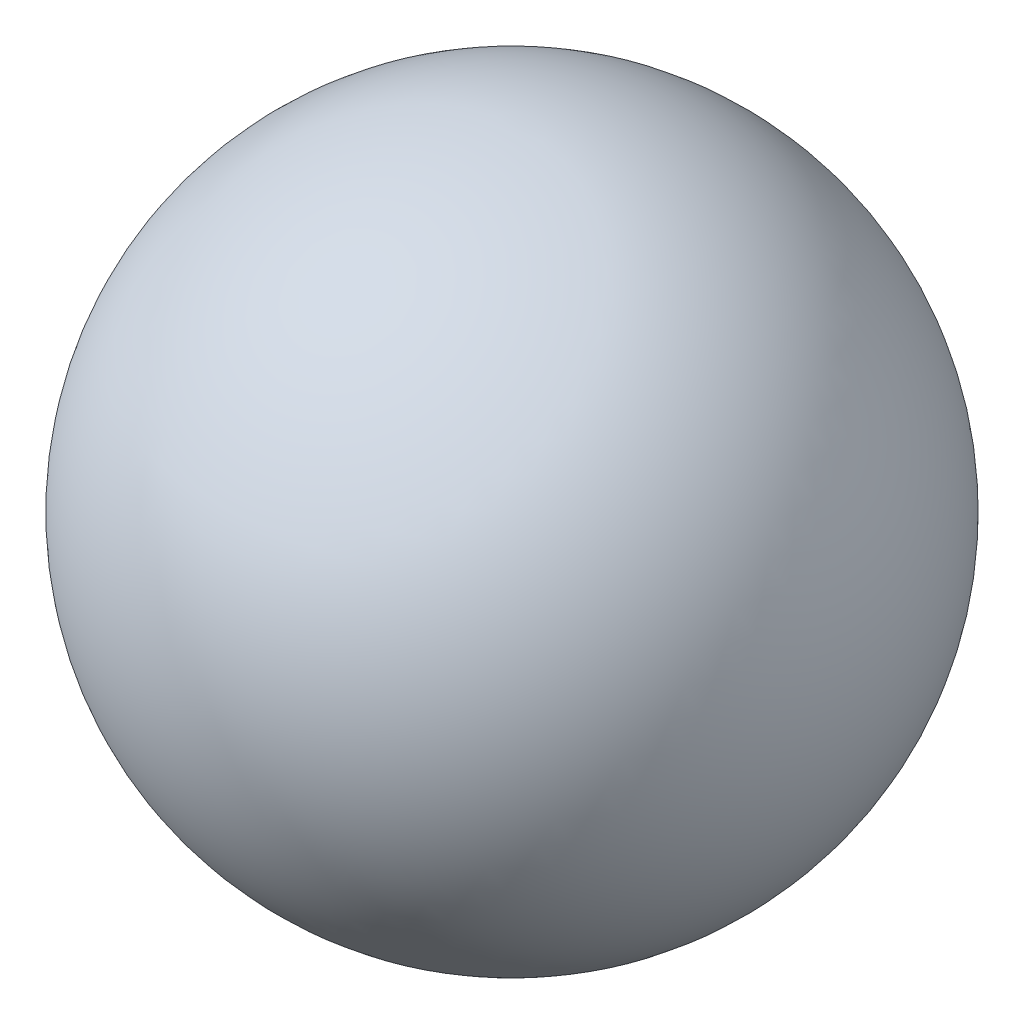
ISO-10303-21;
HEADER;
FILE_DESCRIPTION(('STEP AP214'),'2;1');
FILE_NAME('part.step','',(''),(''),'','','');
FILE_SCHEMA(('AUTOMOTIVE_DESIGN { 1 0 10303 214 1 1 1 1 }'));
ENDSEC;
DATA;
#1=APPLICATION_CONTEXT('core data for automotive mechanical design processes');
#2=APPLICATION_PROTOCOL_DEFINITION('international standard','automotive_design',2000,#1);
#3=PRODUCT_CONTEXT('',#1,'mechanical');
#4=PRODUCT('Part','Part','',(#3));
#5=PRODUCT_RELATED_PRODUCT_CATEGORY('part','',(#4));
#6=PRODUCT_DEFINITION_FORMATION('','',#4);
#7=PRODUCT_DEFINITION_CONTEXT('part definition',#1,'design');
#8=PRODUCT_DEFINITION('design','',#6,#7);
#9=PRODUCT_DEFINITION_SHAPE('','',#8);
#10=(LENGTH_UNIT() NAMED_UNIT(*) SI_UNIT(.MILLI.,.METRE.));
#11=(NAMED_UNIT(*) PLANE_ANGLE_UNIT() SI_UNIT($,.RADIAN.));
#12=(NAMED_UNIT(*) SI_UNIT($,.STERADIAN.) SOLID_ANGLE_UNIT());
#13=UNCERTAINTY_MEASURE_WITH_UNIT(LENGTH_MEASURE(1.E-05),#10,'distance_accuracy_value','');
#14=(GEOMETRIC_REPRESENTATION_CONTEXT(3) GLOBAL_UNCERTAINTY_ASSIGNED_CONTEXT((#13)) GLOBAL_UNIT_ASSIGNED_CONTEXT((#10,
#11,#12)) REPRESENTATION_CONTEXT('',''));
#15=CARTESIAN_POINT('',(0.,0.,0.));
#16=DIRECTION('',(0.,0.,1.));
#17=DIRECTION('',(1.,0.,0.));
#18=AXIS2_PLACEMENT_3D('',#15,#16,#17);
#19=CARTESIAN_POINT('',(0.,0.,0.));
#20=DIRECTION('',(0.,-1.,0.));
#21=DIRECTION('',(-1.,0.,0.));
#22=AXIS2_PLACEMENT_3D('',#19,#20,#21);
#23=SPHERICAL_SURFACE('',#22,15.875);
#24=CARTESIAN_POINT('',(0.,-15.875,0.));
#25=VERTEX_POINT('',#24);
#26=VERTEX_LOOP('',#25);
#27=FACE_BOUND('',#26,.T.);
#28=ADVANCED_FACE('F32',(#27),#23,.T.);
#29=CLOSED_SHELL('',(#28));
#30=CARTESIAN_POINT('',(0.,0.,0.));
#31=DIRECTION('',(0.,-1.,0.));
#32=DIRECTION('',(1.,0.,0.));
#33=AXIS2_PLACEMENT_3D('',#30,#31,#32);
#34=SPHERICAL_SURFACE('',#33,15.3924);
#35=CARTESIAN_POINT('',(0.,-15.3924,0.));
#36=VERTEX_POINT('',#35);
#37=VERTEX_LOOP('',#36);
#38=FACE_BOUND('',#37,.T.);
#39=ADVANCED_FACE('F45',(#38),#34,.F.);
#40=CLOSED_SHELL('',(#39));
#41=ORIENTED_CLOSED_SHELL('',*,#40,.T.);
#42=BREP_WITH_VOIDS('B2',#29,(#41));
#43=ADVANCED_BREP_SHAPE_REPRESENTATION('',(#18,#42),#14);
#44=SHAPE_DEFINITION_REPRESENTATION(#9,#43);
ENDSEC;
END-ISO-10303-21;
